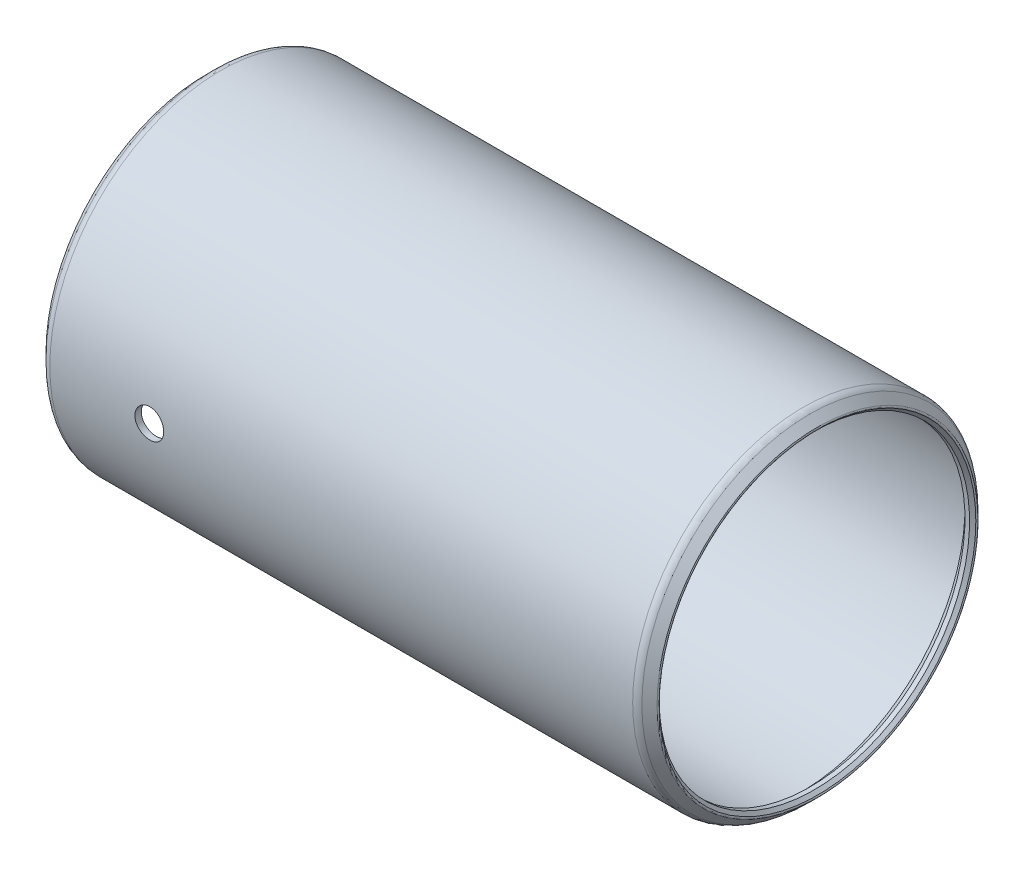
ISO-10303-21;
HEADER;
FILE_DESCRIPTION(('STEP AP214'),'2;1');
FILE_NAME('part.step','',(''),(''),'','','');
FILE_SCHEMA(('AUTOMOTIVE_DESIGN { 1 0 10303 214 1 1 1 1 }'));
ENDSEC;
DATA;
#1=APPLICATION_CONTEXT('core data for automotive mechanical design processes');
#2=APPLICATION_PROTOCOL_DEFINITION('international standard','automotive_design',2000,#1);
#3=PRODUCT_CONTEXT('',#1,'mechanical');
#4=PRODUCT('Part','Part','',(#3));
#5=PRODUCT_RELATED_PRODUCT_CATEGORY('part','',(#4));
#6=PRODUCT_DEFINITION_FORMATION('','',#4);
#7=PRODUCT_DEFINITION_CONTEXT('part definition',#1,'design');
#8=PRODUCT_DEFINITION('design','',#6,#7);
#9=PRODUCT_DEFINITION_SHAPE('','',#8);
#10=(LENGTH_UNIT() NAMED_UNIT(*) SI_UNIT(.MILLI.,.METRE.));
#11=(NAMED_UNIT(*) PLANE_ANGLE_UNIT() SI_UNIT($,.RADIAN.));
#12=(NAMED_UNIT(*) SI_UNIT($,.STERADIAN.) SOLID_ANGLE_UNIT());
#13=UNCERTAINTY_MEASURE_WITH_UNIT(LENGTH_MEASURE(1.E-05),#10,'distance_accuracy_value','');
#14=(GEOMETRIC_REPRESENTATION_CONTEXT(3) GLOBAL_UNCERTAINTY_ASSIGNED_CONTEXT((#13)) GLOBAL_UNIT_ASSIGNED_CONTEXT((#10,
#11,#12)) REPRESENTATION_CONTEXT('',''));
#15=CARTESIAN_POINT('',(0.,0.,0.));
#16=DIRECTION('',(0.,0.,1.));
#17=DIRECTION('',(1.,0.,0.));
#18=AXIS2_PLACEMENT_3D('',#15,#16,#17);
#19=CARTESIAN_POINT('',(49.3014,0.,0.));
#20=DIRECTION('',(-1.,0.,0.));
#21=DIRECTION('',(0.,0.,1.));
#22=AXIS2_PLACEMENT_3D('',#19,#20,#21);
#23=CYLINDRICAL_SURFACE('',#22,13.60805);
#24=CARTESIAN_POINT('',(0.761999999999999,0.,0.));
#25=DIRECTION('',(-1.,0.,0.));
#26=DIRECTION('',(0.,0.,1.));
#27=AXIS2_PLACEMENT_3D('',#24,#25,#26);
#28=CIRCLE('',#27,13.60805);
#29=CARTESIAN_POINT('',(0.761999999999999,0.,13.60805));
#30=VERTEX_POINT('',#29);
#31=EDGE_CURVE('E56',#30,#30,#28,.T.);
#32=ORIENTED_EDGE('',*,*,#31,.T.);
#33=EDGE_LOOP('',(#32));
#34=FACE_BOUND('',#33,.T.);
#35=CARTESIAN_POINT('',(48.5394,0.,0.));
#36=DIRECTION('',(-1.,0.,0.));
#37=DIRECTION('',(0.,0.,1.));
#38=AXIS2_PLACEMENT_3D('',#35,#36,#37);
#39=CIRCLE('',#38,13.60805);
#40=CARTESIAN_POINT('',(48.5394,0.,13.60805));
#41=VERTEX_POINT('',#40);
#42=EDGE_CURVE('E59',#41,#41,#39,.T.);
#43=ORIENTED_EDGE('',*,*,#42,.F.);
#44=EDGE_LOOP('',(#43));
#45=FACE_BOUND('',#44,.T.);
#46=CARTESIAN_POINT('',(9.9568,0.,13.60805));
#47=CARTESIAN_POINT('',(9.95679708301894,-0.0669182546482714,13.608049316548));
#48=CARTESIAN_POINT('',(9.9511544323396,-0.133881741871161,13.6075511313661));
#49=CARTESIAN_POINT('',(9.92872838455429,-0.265955050546539,13.6056116722791));
#50=CARTESIAN_POINT('',(9.91193245128793,-0.331062700079983,13.6041693371863));
#51=CARTESIAN_POINT('',(9.8676900846028,-0.457492452892776,13.600504525612));
#52=CARTESIAN_POINT('',(9.84024977771192,-0.518816710269826,13.5982824979641));
#53=CARTESIAN_POINT('',(9.77550878988491,-0.635974564806711,13.5933073106333));
#54=CARTESIAN_POINT('',(9.73821018149235,-0.691809312663339,13.5905542626213));
#55=CARTESIAN_POINT('',(9.65469848449648,-0.7965743137312,13.5848171871262));
#56=CARTESIAN_POINT('',(9.60846341826353,-0.845487018835932,13.5818326012789));
#57=CARTESIAN_POINT('',(9.50843782103866,-0.934868846378991,13.5759734995207));
#58=CARTESIAN_POINT('',(9.4546469541021,-0.975337593184629,13.5730989885111));
#59=CARTESIAN_POINT('',(9.34092941918919,-1.04674292044388,13.5677795828556));
#60=CARTESIAN_POINT('',(9.280992951096,-1.07766395049416,13.565335391827));
#61=CARTESIAN_POINT('',(9.1567538010192,-1.12899678917914,13.5611599143374));
#62=CARTESIAN_POINT('',(9.09245120371227,-1.14940880155976,13.5594286140552));
#63=CARTESIAN_POINT('',(8.96148184852376,-1.17909296626753,13.5568797393416));
#64=CARTESIAN_POINT('',(8.8948216509038,-1.18839385737639,13.5560598080495));
#65=CARTESIAN_POINT('',(8.76088164230416,-1.19568055751461,13.5554190966986));
#66=CARTESIAN_POINT('',(8.69360184412538,-1.19366659978648,13.555598296044));
#67=CARTESIAN_POINT('',(8.56052969101664,-1.17840450616186,13.5569334538123));
#68=CARTESIAN_POINT('',(8.49473371875241,-1.16518763914177,13.5580866935214));
#69=CARTESIAN_POINT('',(8.36629761654667,-1.12794350298004,13.5612357313031));
#70=CARTESIAN_POINT('',(8.30365752035618,-1.10391611825092,13.5632315383846));
#71=CARTESIAN_POINT('',(8.18321185861607,-1.04569810788095,13.5678439633093));
#72=CARTESIAN_POINT('',(8.12541308946077,-1.0114934917358,13.5704614347403));
#73=CARTESIAN_POINT('',(8.01636511195066,-0.933902039337988,13.5760214947568));
#74=CARTESIAN_POINT('',(7.96511605083599,-0.890514996718806,13.5789640906484));
#75=CARTESIAN_POINT('',(7.87044047693493,-0.795615092475709,13.5848549435303));
#76=CARTESIAN_POINT('',(7.82704104819841,-0.744075205315693,13.5878031859359));
#77=CARTESIAN_POINT('',(7.74950622419902,-0.63442681602597,13.5933636651988));
#78=CARTESIAN_POINT('',(7.71537083604385,-0.576318308856632,13.5959759017984));
#79=CARTESIAN_POINT('',(7.65733461000234,-0.455164276524884,13.6005706231754));
#80=CARTESIAN_POINT('',(7.63343501463544,-0.392118153085045,13.6025530314905));
#81=CARTESIAN_POINT('',(7.5965679764888,-0.262886805098121,13.6056638839094));
#82=CARTESIAN_POINT('',(7.58360028224248,-0.196701652795131,13.6067923476564));
#83=CARTESIAN_POINT('',(7.56899920769066,-0.0633057084379338,13.6080656427365));
#84=CARTESIAN_POINT('',(7.5673284262197,0.00390096014763275,13.6082137198431));
#85=CARTESIAN_POINT('',(7.57527056376644,0.137638382320868,13.6075182347554));
#86=CARTESIAN_POINT('',(7.58488336595981,0.204169142899341,13.6066746828279));
#87=CARTESIAN_POINT('',(7.61508879198431,0.334559219682892,13.6040928727499));
#88=CARTESIAN_POINT('',(7.63566403643894,0.398422592305757,13.6023560309328));
#89=CARTESIAN_POINT('',(7.68719251361759,0.521790806302529,13.5981826863816));
#90=CARTESIAN_POINT('',(7.71814592753115,0.581295571558635,13.5957461714322));
#91=CARTESIAN_POINT('',(7.78964577513802,0.694427383789485,13.5904383750868));
#92=CARTESIAN_POINT('',(7.83021693615532,0.748038749909508,13.5875659800053));
#93=CARTESIAN_POINT('',(7.91976495742895,0.847703536830346,13.5817127326722));
#94=CARTESIAN_POINT('',(7.96874197958377,0.893756812027454,13.5787318783325));
#95=CARTESIAN_POINT('',(8.07387396535874,0.977126813007207,13.5729880250846));
#96=CARTESIAN_POINT('',(8.13004834977849,1.01441909752546,13.5702256495799));
#97=CARTESIAN_POINT('',(8.24788402429577,1.07904083433481,13.5652405289984));
#98=CARTESIAN_POINT('',(8.30954525454217,1.10637039528381,13.5630177780363));
#99=CARTESIAN_POINT('',(8.43651841293467,1.15024944112672,13.559367185593));
#100=CARTESIAN_POINT('',(8.50182517357792,1.1668137844106,13.5579382488695));
#101=CARTESIAN_POINT('',(8.63430609227215,1.18874053042524,13.5560334832072));
#102=CARTESIAN_POINT('',(8.70148021010278,1.19410317423634,13.5555576337563));
#103=CARTESIAN_POINT('',(8.83554611693338,1.19347137557144,13.5556132553957));
#104=CARTESIAN_POINT('',(8.90243809165198,1.18751533298986,13.5561413205969));
#105=CARTESIAN_POINT('',(9.03426766120116,1.1644954120055,13.5581380294439));
#106=CARTESIAN_POINT('',(9.09920525322321,1.14743151764102,13.5596066744412));
#107=CARTESIAN_POINT('',(9.22528451287958,1.10269022427221,13.5633181559878));
#108=CARTESIAN_POINT('',(9.2864264674737,1.07501362875311,13.5655609339264));
#109=CARTESIAN_POINT('',(9.40320259425023,1.00983676557016,13.5705680835019));
#110=CARTESIAN_POINT('',(9.45883683910169,0.972336627542543,13.5733324482555));
#111=CARTESIAN_POINT('',(9.56321493671497,0.888432807982476,13.5790824775698));
#112=CARTESIAN_POINT('',(9.61193584490628,0.842000630023596,13.5820688311231));
#113=CARTESIAN_POINT('',(9.70091338867967,0.741603984891418,13.5879200468851));
#114=CARTESIAN_POINT('',(9.74116797861839,0.6876377025462,13.5907848795984));
#115=CARTESIAN_POINT('',(9.81213036633629,0.573589955763267,13.5960759911951));
#116=CARTESIAN_POINT('',(9.84281871286696,0.513496357359421,13.5985013723955));
#117=CARTESIAN_POINT('',(9.89362986284665,0.389028363158872,13.6026300080547));
#118=CARTESIAN_POINT('',(9.91376475422052,0.324658960547063,13.6043340882591));
#119=CARTESIAN_POINT('',(9.93779579646115,0.216594595648881,13.6063929318442));
#120=CARTESIAN_POINT('',(9.94491283573995,0.17359363107121,13.6070114866693));
#121=CARTESIAN_POINT('',(9.95441587945564,0.0870681605825598,13.6078402424959));
#122=CARTESIAN_POINT('',(9.95680189807731,0.0435436562416747,13.6080504447217));
#123=CARTESIAN_POINT('',(9.9568,0.,13.60805));
#124=B_SPLINE_CURVE_WITH_KNOTS('',3,(#46,#47,#48,#49,#50,#51,#52,#53,#54,#55,#56,#57,#58,#59,
#60,#61,#62,#63,#64,#65,#66,#67,#68,#69,#70,#71,#72,#73,#74,#75,#76,#77,#78,#79,#80,#81,#82,#83,
#84,#85,#86,#87,#88,#89,#90,#91,#92,#93,#94,#95,#96,#97,#98,#99,#100,#101,#102,#103,#104,#105,
#106,#107,#108,#109,#110,#111,#112,#113,#114,#115,#116,#117,#118,#119,#120,#121,#122,#123),
.UNSPECIFIED.,.T.,.F.,(4,2,2,2,2,2,2,2,2,2,2,2,2,2,2,2,2,2,2,2,2,2,2,2,2,2,2,2,2,2,2,2,2,2,2,2,
2,2,4),(0.,0.200595776364208,0.401417402555723,0.602123613959345,0.802787663743493,
1.00395163894922,1.20512456110373,1.40662342685357,1.60811838585192,1.80909104431727,
2.01005955997897,2.21046898470325,2.41088055228259,2.61156890595592,2.81226177039288,
3.01363441008906,3.21500720428504,3.41640443613274,3.61779703511228,3.81852254723748,
4.0192459811741,4.21965213971364,4.42006179727014,4.62099240769906,4.82192688852443,
5.02341544728019,5.22490180844603,5.42610947975999,5.62731282068517,5.82783477543158,
6.02835701832369,6.22886408271802,6.42936850125701,6.63052354054656,6.83172712749547,
7.03333719694748,7.23471583483494,7.36524374182047,7.49577125745048),.UNSPECIFIED.);
#125=CARTESIAN_POINT('',(9.9568,0.,13.60805));
#126=VERTEX_POINT('',#125);
#127=EDGE_CURVE('E89',#126,#126,#124,.T.);
#128=ORIENTED_EDGE('',*,*,#127,.F.);
#129=EDGE_LOOP('',(#128));
#130=FACE_BOUND('',#129,.T.);
#131=ADVANCED_FACE('F32',(#34,#45,#130),#23,.F.);
#132=CARTESIAN_POINT('',(49.3014,0.,0.));
#133=DIRECTION('',(-1.,0.,0.));
#134=DIRECTION('',(0.,0.,1.));
#135=AXIS2_PLACEMENT_3D('',#132,#133,#134);
#136=CYLINDRICAL_SURFACE('',#135,14.1351000000002);
#137=CARTESIAN_POINT('',(0.527049999997843,0.,0.));
#138=DIRECTION('',(-1.,0.,0.));
#139=DIRECTION('',(0.,0.,1.));
#140=AXIS2_PLACEMENT_3D('',#137,#138,#139);
#141=CIRCLE('',#140,14.1351000000002);
#142=CARTESIAN_POINT('',(0.527049999997843,0.,14.1351000000002));
#143=VERTEX_POINT('',#142);
#144=EDGE_CURVE('E80',#143,#143,#141,.T.);
#145=ORIENTED_EDGE('',*,*,#144,.F.);
#146=EDGE_LOOP('',(#145));
#147=FACE_BOUND('',#146,.T.);
#148=CARTESIAN_POINT('',(48.7743500000017,0.,0.));
#149=DIRECTION('',(-1.,0.,0.));
#150=DIRECTION('',(0.,0.,1.));
#151=AXIS2_PLACEMENT_3D('',#148,#149,#150);
#152=CIRCLE('',#151,14.1351000000002);
#153=CARTESIAN_POINT('',(48.7743500000017,0.,14.1351000000002));
#154=VERTEX_POINT('',#153);
#155=EDGE_CURVE('E77',#154,#154,#152,.T.);
#156=ORIENTED_EDGE('',*,*,#155,.T.);
#157=EDGE_LOOP('',(#156));
#158=FACE_BOUND('',#157,.T.);
#159=CARTESIAN_POINT('',(7.5692,0.,14.1351000000002));
#160=CARTESIAN_POINT('',(7.56920292181596,-0.0669283271261537,14.1350993401614));
#161=CARTESIAN_POINT('',(7.57484726399437,-0.133902135301032,14.1346195848798));
#162=CARTESIAN_POINT('',(7.59728042319043,-0.265996491031899,14.1327518733435));
#163=CARTESIAN_POINT('',(7.6140818446467,-0.331114855572768,14.1313628899358));
#164=CARTESIAN_POINT('',(7.65833963765327,-0.457566086300831,14.1278336735272));
#165=CARTESIAN_POINT('',(7.68578995527623,-0.518901080423648,14.125693867437));
#166=CARTESIAN_POINT('',(7.75055543839332,-0.636078307307289,14.1209029302645));
#167=CARTESIAN_POINT('',(7.78786850294064,-0.691921706407142,14.1182519081132));
#168=CARTESIAN_POINT('',(7.87140556793543,-0.796691100327122,14.1127282376208));
#169=CARTESIAN_POINT('',(7.91765002219988,-0.845600761572882,14.1098550898244));
#170=CARTESIAN_POINT('',(8.01769391089028,-0.934974155924522,14.1042151767763));
#171=CARTESIAN_POINT('',(8.07149367808737,-0.975437516820743,14.1014484162173));
#172=CARTESIAN_POINT('',(8.18522013921747,-1.04682516542564,14.0963291859555));
#173=CARTESIAN_POINT('',(8.24515589291446,-1.07773506898988,14.0939773432359));
#174=CARTESIAN_POINT('',(8.36938985270397,-1.12904650202633,14.0899599818293));
#175=CARTESIAN_POINT('',(8.4336879798337,-1.14944822164851,14.0882944507233));
#176=CARTESIAN_POINT('',(8.56465764061446,-1.17911671021048,14.0858425083406));
#177=CARTESIAN_POINT('',(8.63132309864346,-1.18841012291819,14.0850539938179));
#178=CARTESIAN_POINT('',(8.76527196549844,-1.19568050509525,14.08443872305));
#179=CARTESIAN_POINT('',(8.83255536241638,-1.19365769217976,14.0846119483102));
#180=CARTESIAN_POINT('',(8.96564752296844,-1.17837506017275,14.0858986730768));
#181=CARTESIAN_POINT('',(9.03145963928094,-1.1651442060237,14.0870097488696));
#182=CARTESIAN_POINT('',(9.15992568462764,-1.12786607104217,14.0900431828305));
#183=CARTESIAN_POINT('',(9.22257958207598,-1.10381868205565,14.0919655491106));
#184=CARTESIAN_POINT('',(9.34304293012354,-1.04555769253766,14.0964077496589));
#185=CARTESIAN_POINT('',(9.40084607074476,-1.01133110566503,14.0989283462984));
#186=CARTESIAN_POINT('',(9.50989807835045,-0.933692647803003,14.1042822979228));
#187=CARTESIAN_POINT('',(9.56114680890691,-0.890280585670664,14.1071156594157));
#188=CARTESIAN_POINT('',(9.65580364295232,-0.795341071971393,14.1127866730802));
#189=CARTESIAN_POINT('',(9.69918663747083,-0.743788581375683,14.115624310815));
#190=CARTESIAN_POINT('',(9.77668634820717,-0.634118926305164,14.1209756782484));
#191=CARTESIAN_POINT('',(9.81080305801055,-0.576001757286086,14.1234894077227));
#192=CARTESIAN_POINT('',(9.86880022219154,-0.454836092003784,14.1279102278279));
#193=CARTESIAN_POINT('',(9.89267955450346,-0.391787056079347,14.1298172519551));
#194=CARTESIAN_POINT('',(9.92950648637397,-0.262554923079166,14.1328090346272));
#195=CARTESIAN_POINT('',(9.94245431896717,-0.196371892844792,14.1338938107006));
#196=CARTESIAN_POINT('',(9.95701920600603,-0.0629680933603924,14.1351166222717));
#197=CARTESIAN_POINT('',(9.95867094036536,0.0042488641500376,14.1352575554143));
#198=CARTESIAN_POINT('',(9.95068760810625,0.138003690936404,14.1345845426698));
#199=CARTESIAN_POINT('',(9.94105264966805,0.204541566715009,14.1337706059351));
#200=CARTESIAN_POINT('',(9.91079817844433,0.334950504129665,14.1312812487312));
#201=CARTESIAN_POINT('',(9.89019475037927,0.398825323483858,14.1296070898602));
#202=CARTESIAN_POINT('',(9.83860463060446,0.52221140061772,14.1255853425755));
#203=CARTESIAN_POINT('',(9.80761777042593,0.581722587579367,14.1232377432353));
#204=CARTESIAN_POINT('',(9.73605330986646,0.6948498536896,14.1181250228166));
#205=CARTESIAN_POINT('',(9.69545274639488,0.748451360742455,14.1153589078816));
#206=CARTESIAN_POINT('',(9.60584653631726,0.848090595113095,14.1097232324077));
#207=CARTESIAN_POINT('',(9.55684073971241,0.894128187417424,14.1068536700234));
#208=CARTESIAN_POINT('',(9.45166461794951,0.977451800981744,14.1013259313809));
#209=CARTESIAN_POINT('',(9.39547632423666,1.01471518341474,14.0986683133941));
#210=CARTESIAN_POINT('',(9.27761957894872,1.07927735451325,14.0938733119402));
#211=CARTESIAN_POINT('',(9.21595118336847,1.10657624497985,14.0917359231583));
#212=CARTESIAN_POINT('',(9.08896477896685,1.15039599483741,14.0882265385032));
#213=CARTESIAN_POINT('',(9.02365157231614,1.16693068869567,14.0868535605165));
#214=CARTESIAN_POINT('',(8.89116384521411,1.18879771905824,14.08502517905));
#215=CARTESIAN_POINT('',(8.82398936161352,1.19413027718917,14.0845697574169));
#216=CARTESIAN_POINT('',(8.68991090470376,1.1934390725901,14.0846283256227));
#217=CARTESIAN_POINT('',(8.62300674382314,1.1874508799686,14.0851392790867));
#218=CARTESIAN_POINT('',(8.4911579962589,1.16436235213308,14.0870665729209));
#219=CARTESIAN_POINT('',(8.42621341252206,1.14726200020965,14.0884829146525));
#220=CARTESIAN_POINT('',(8.30012520184654,1.10244363127395,14.0920605969999));
#221=CARTESIAN_POINT('',(8.23898133647735,1.07472628108087,14.0942218908269));
#222=CARTESIAN_POINT('',(8.12220888360784,1.00946467384946,14.0990460309783));
#223=CARTESIAN_POINT('',(8.06658021301955,0.971920564885073,14.1017088697449));
#224=CARTESIAN_POINT('',(7.962235186184,0.887937513679702,14.1072460196814));
#225=CARTESIAN_POINT('',(7.91354007085993,0.841472220861158,14.1101209413925));
#226=CARTESIAN_POINT('',(7.82462008071477,0.741013935895547,14.1157527492686));
#227=CARTESIAN_POINT('',(7.78439725693728,0.687019126185856,14.1185096067233));
#228=CARTESIAN_POINT('',(7.71350817019649,0.572927772140121,14.1235997666305));
#229=CARTESIAN_POINT('',(7.68286022000887,0.512819823292392,14.1259322539245));
#230=CARTESIAN_POINT('',(7.63213124684047,0.388332241258136,14.1299013567546));
#231=CARTESIAN_POINT('',(7.61203809165175,0.323957608729381,14.1315387708251));
#232=CARTESIAN_POINT('',(7.58809979422027,0.216003457892249,14.1335134371226));
#233=CARTESIAN_POINT('',(7.58102180785904,0.173117960922013,14.134105685622));
#234=CARTESIAN_POINT('',(7.57157096934717,0.0868280234485226,14.1348991805792));
#235=CARTESIAN_POINT('',(7.5691981043046,0.043423584367487,14.1351004281084));
#236=CARTESIAN_POINT('',(7.5692,0.,14.1351000000002));
#237=B_SPLINE_CURVE_WITH_KNOTS('',3,(#159,#160,#161,#162,#163,#164,#165,#166,#167,#168,#169,
#170,#171,#172,#173,#174,#175,#176,#177,#178,#179,#180,#181,#182,#183,#184,#185,#186,#187,#188,
#189,#190,#191,#192,#193,#194,#195,#196,#197,#198,#199,#200,#201,#202,#203,#204,#205,#206,#207,
#208,#209,#210,#211,#212,#213,#214,#215,#216,#217,#218,#219,#220,#221,#222,#223,#224,#225,#226,
#227,#228,#229,#230,#231,#232,#233,#234,#235,#236),.UNSPECIFIED.,.T.,.F.,(4,2,2,2,2,2,2,2,2,2,2,
2,2,2,2,2,2,2,2,2,2,2,2,2,2,2,2,2,2,2,2,2,2,2,2,2,2,2,4),(0.,0.200626436393935,
0.401479912090747,0.60221936896414,0.80291609904774,1.00407801556242,1.20524879496448,
1.40672100759489,1.60818957437337,1.80917393388867,2.01015442841468,2.21061710799124,
2.41108179202985,2.61180332856396,2.81252904237544,3.01388464415477,3.21524038531934,
3.41661819040051,3.61799170245818,3.81874670329254,4.01949977995424,4.21995926979817,
4.42042201220841,4.62136849367328,4.82231856157891,5.02378156560598,5.2252425113519,
5.42644401960252,5.62764154718096,5.82820795709324,6.02877466859883,6.22932878522545,
6.4298798799882,6.63103271998156,6.83223420091932,7.03381817408425,7.23516992672128,
7.36533817134602,7.49550605931189),.UNSPECIFIED.);
#238=CARTESIAN_POINT('',(7.5692,0.,14.1351000000002));
#239=VERTEX_POINT('',#238);
#240=EDGE_CURVE('E10',#239,#239,#237,.T.);
#241=ORIENTED_EDGE('',*,*,#240,.F.);
#242=EDGE_LOOP('',(#241));
#243=FACE_BOUND('',#242,.T.);
#244=ADVANCED_FACE('F110',(#147,#158,#243),#136,.T.);
#245=CARTESIAN_POINT('',(-0.549710244842028,0.,0.));
#246=DIRECTION('',(-1.,0.,0.));
#247=DIRECTION('',(0.,0.,1.));
#248=AXIS2_PLACEMENT_3D('',#245,#246,#247);
#249=TOROIDAL_SURFACE('',#248,13.194365367264,0.127000000000741);
#250=CARTESIAN_POINT('',(-0.639512806053462,0.,0.));
#251=DIRECTION('',(-1.,0.,0.));
#252=DIRECTION('',(0.,0.,1.));
#253=AXIS2_PLACEMENT_3D('',#250,#251,#252);
#254=CIRCLE('',#253,13.104562806053);
#255=CARTESIAN_POINT('',(-0.639512806053462,0.,13.104562806053));
#256=VERTEX_POINT('',#255);
#257=EDGE_CURVE('E43',#256,#256,#254,.T.);
#258=ORIENTED_EDGE('',*,*,#257,.F.);
#259=EDGE_LOOP('',(#258));
#260=FACE_BOUND('',#259,.T.);
#261=CARTESIAN_POINT('',(-0.639512806053018,0.,0.));
#262=DIRECTION('',(-1.,0.,0.));
#263=DIRECTION('',(0.,0.,1.));
#264=AXIS2_PLACEMENT_3D('',#261,#262,#263);
#265=CIRCLE('',#264,13.2841679284754);
#266=CARTESIAN_POINT('',(-0.639512806053018,0.,13.2841679284754));
#267=VERTEX_POINT('',#266);
#268=EDGE_CURVE('E86',#267,#267,#265,.T.);
#269=ORIENTED_EDGE('',*,*,#268,.T.);
#270=EDGE_LOOP('',(#269));
#271=FACE_BOUND('',#270,.T.);
#272=ADVANCED_FACE('F34',(#260,#271),#249,.T.);
#273=CARTESIAN_POINT('',(-0.639512806053462,0.,0.));
#274=DIRECTION('',(-1.,0.,0.));
#275=DIRECTION('',(0.,0.,1.));
#276=AXIS2_PLACEMENT_3D('',#273,#274,#275);
#277=CONICAL_SURFACE('',#276,13.104562806053,0.785398163396556);
#278=CARTESIAN_POINT('',(-0.380999999999999,0.,0.));
#279=DIRECTION('',(-1.,0.,0.));
#280=DIRECTION('',(0.,0.,1.));
#281=AXIS2_PLACEMENT_3D('',#278,#279,#280);
#282=CIRCLE('',#281,12.84605);
#283=CARTESIAN_POINT('',(-0.380999999999999,0.,12.84605));
#284=VERTEX_POINT('',#283);
#285=EDGE_CURVE('E47',#284,#284,#282,.T.);
#286=ORIENTED_EDGE('',*,*,#285,.F.);
#287=EDGE_LOOP('',(#286));
#288=FACE_BOUND('',#287,.T.);
#289=ORIENTED_EDGE('',*,*,#257,.T.);
#290=EDGE_LOOP('',(#289));
#291=FACE_BOUND('',#290,.T.);
#292=ADVANCED_FACE('F159',(#288,#291),#277,.F.);
#293=CARTESIAN_POINT('',(49.3014,0.,0.));
#294=DIRECTION('',(-1.,0.,0.));
#295=DIRECTION('',(0.,0.,1.));
#296=AXIS2_PLACEMENT_3D('',#293,#294,#295);
#297=CYLINDRICAL_SURFACE('',#296,12.84605);
#298=CARTESIAN_POINT('',(0.,0.,0.));
#299=DIRECTION('',(-1.,0.,0.));
#300=DIRECTION('',(0.,0.,1.));
#301=AXIS2_PLACEMENT_3D('',#298,#299,#300);
#302=CIRCLE('',#301,12.84605);
#303=CARTESIAN_POINT('',(0.,0.,12.84605));
#304=VERTEX_POINT('',#303);
#305=EDGE_CURVE('E51',#304,#304,#302,.T.);
#306=ORIENTED_EDGE('',*,*,#305,.F.);
#307=EDGE_LOOP('',(#306));
#308=FACE_BOUND('',#307,.T.);
#309=ORIENTED_EDGE('',*,*,#285,.T.);
#310=EDGE_LOOP('',(#309));
#311=FACE_BOUND('',#310,.T.);
#312=ADVANCED_FACE('F140',(#308,#311),#297,.F.);
#313=CARTESIAN_POINT('',(0.,0.,0.));
#314=DIRECTION('',(1.,0.,0.));
#315=DIRECTION('',(0.,0.,-1.));
#316=AXIS2_PLACEMENT_3D('',#313,#314,#315);
#317=CONICAL_SURFACE('',#316,12.84605,0.78539816339745);
#318=ORIENTED_EDGE('',*,*,#31,.F.);
#319=EDGE_LOOP('',(#318));
#320=FACE_BOUND('',#319,.T.);
#321=ORIENTED_EDGE('',*,*,#305,.T.);
#322=EDGE_LOOP('',(#321));
#323=FACE_BOUND('',#322,.T.);
#324=ADVANCED_FACE('F135',(#320,#323),#317,.F.);
#325=CARTESIAN_POINT('',(48.5394,0.,0.));
#326=DIRECTION('',(-1.,0.,0.));
#327=DIRECTION('',(0.,0.,1.));
#328=AXIS2_PLACEMENT_3D('',#325,#326,#327);
#329=CONICAL_SURFACE('',#328,13.60805,0.78539816339745);
#330=CARTESIAN_POINT('',(49.3014,0.,0.));
#331=DIRECTION('',(-1.,0.,0.));
#332=DIRECTION('',(0.,0.,1.));
#333=AXIS2_PLACEMENT_3D('',#330,#331,#332);
#334=CIRCLE('',#333,12.84605);
#335=CARTESIAN_POINT('',(49.3014,0.,12.84605));
#336=VERTEX_POINT('',#335);
#337=EDGE_CURVE('E62',#336,#336,#334,.T.);
#338=ORIENTED_EDGE('',*,*,#337,.F.);
#339=EDGE_LOOP('',(#338));
#340=FACE_BOUND('',#339,.T.);
#341=ORIENTED_EDGE('',*,*,#42,.T.);
#342=EDGE_LOOP('',(#341));
#343=FACE_BOUND('',#342,.T.);
#344=ADVANCED_FACE('F132',(#340,#343),#329,.F.);
#345=CARTESIAN_POINT('',(49.3014,0.,0.));
#346=DIRECTION('',(-1.,0.,0.));
#347=DIRECTION('',(0.,0.,1.));
#348=AXIS2_PLACEMENT_3D('',#345,#346,#347);
#349=CYLINDRICAL_SURFACE('',#348,12.84605);
#350=CARTESIAN_POINT('',(49.6824,0.,0.));
#351=DIRECTION('',(-1.,0.,0.));
#352=DIRECTION('',(0.,0.,1.));
#353=AXIS2_PLACEMENT_3D('',#350,#351,#352);
#354=CIRCLE('',#353,12.84605);
#355=CARTESIAN_POINT('',(49.6824,0.,12.84605));
#356=VERTEX_POINT('',#355);
#357=EDGE_CURVE('E65',#356,#356,#354,.T.);
#358=ORIENTED_EDGE('',*,*,#357,.F.);
#359=EDGE_LOOP('',(#358));
#360=FACE_BOUND('',#359,.T.);
#361=ORIENTED_EDGE('',*,*,#337,.T.);
#362=EDGE_LOOP('',(#361));
#363=FACE_BOUND('',#362,.T.);
#364=ADVANCED_FACE('F129',(#360,#363),#349,.F.);
#365=CARTESIAN_POINT('',(49.6824,0.,0.));
#366=DIRECTION('',(1.,0.,0.));
#367=DIRECTION('',(0.,0.,-1.));
#368=AXIS2_PLACEMENT_3D('',#365,#366,#367);
#369=CONICAL_SURFACE('',#368,12.84605,0.785398163397321);
#370=CARTESIAN_POINT('',(49.9409128060541,0.,0.));
#371=DIRECTION('',(-1.,0.,0.));
#372=DIRECTION('',(0.,0.,1.));
#373=AXIS2_PLACEMENT_3D('',#370,#371,#372);
#374=CIRCLE('',#373,13.104562806054);
#375=CARTESIAN_POINT('',(49.9409128060541,0.,13.104562806054));
#376=VERTEX_POINT('',#375);
#377=EDGE_CURVE('E68',#376,#376,#374,.T.);
#378=ORIENTED_EDGE('',*,*,#377,.F.);
#379=EDGE_LOOP('',(#378));
#380=FACE_BOUND('',#379,.T.);
#381=ORIENTED_EDGE('',*,*,#357,.T.);
#382=EDGE_LOOP('',(#381));
#383=FACE_BOUND('',#382,.T.);
#384=ADVANCED_FACE('F125',(#380,#383),#369,.F.);
#385=CARTESIAN_POINT('',(49.8511102448439,0.,0.));
#386=DIRECTION('',(-1.,0.,0.));
#387=DIRECTION('',(0.,0.,1.));
#388=AXIS2_PLACEMENT_3D('',#385,#386,#387);
#389=TOROIDAL_SURFACE('',#388,13.194365367264,0.126999999999108);
#390=CARTESIAN_POINT('',(49.940912806054,0.,0.));
#391=DIRECTION('',(-1.,0.,0.));
#392=DIRECTION('',(0.,0.,1.));
#393=AXIS2_PLACEMENT_3D('',#390,#391,#392);
#394=CIRCLE('',#393,13.2841679284741);
#395=CARTESIAN_POINT('',(49.940912806054,0.,13.2841679284741));
#396=VERTEX_POINT('',#395);
#397=EDGE_CURVE('E71',#396,#396,#394,.T.);
#398=ORIENTED_EDGE('',*,*,#397,.F.);
#399=EDGE_LOOP('',(#398));
#400=FACE_BOUND('',#399,.T.);
#401=ORIENTED_EDGE('',*,*,#377,.T.);
#402=EDGE_LOOP('',(#401));
#403=FACE_BOUND('',#402,.T.);
#404=ADVANCED_FACE('F121',(#400,#403),#389,.T.);
#405=CARTESIAN_POINT('',(49.940912806054,0.,0.));
#406=DIRECTION('',(-1.,0.,0.));
#407=DIRECTION('',(0.,0.,1.));
#408=AXIS2_PLACEMENT_3D('',#405,#406,#407);
#409=CONICAL_SURFACE('',#408,13.2841679284741,0.785398163397483);
#410=CARTESIAN_POINT('',(49.3131653672624,0.,0.));
#411=DIRECTION('',(-1.,0.,0.));
#412=DIRECTION('',(0.,0.,1.));
#413=AXIS2_PLACEMENT_3D('',#410,#411,#412);
#414=CIRCLE('',#413,13.9119153672658);
#415=CARTESIAN_POINT('',(49.3131653672624,0.,13.9119153672658));
#416=VERTEX_POINT('',#415);
#417=EDGE_CURVE('E74',#416,#416,#414,.T.);
#418=ORIENTED_EDGE('',*,*,#417,.F.);
#419=EDGE_LOOP('',(#418));
#420=FACE_BOUND('',#419,.T.);
#421=ORIENTED_EDGE('',*,*,#397,.T.);
#422=EDGE_LOOP('',(#421));
#423=FACE_BOUND('',#422,.T.);
#424=ADVANCED_FACE('F117',(#420,#423),#409,.T.);
#425=CARTESIAN_POINT('',(48.7743500000017,0.,0.));
#426=DIRECTION('',(-1.,0.,0.));
#427=DIRECTION('',(0.,0.,1.));
#428=AXIS2_PLACEMENT_3D('',#425,#426,#427);
#429=TOROIDAL_SURFACE('',#428,13.3731000000049,0.761999999995191);
#430=ORIENTED_EDGE('',*,*,#155,.F.);
#431=EDGE_LOOP('',(#430));
#432=FACE_BOUND('',#431,.T.);
#433=ORIENTED_EDGE('',*,*,#417,.T.);
#434=EDGE_LOOP('',(#433));
#435=FACE_BOUND('',#434,.T.);
#436=ADVANCED_FACE('F108',(#432,#435),#429,.T.);
#437=CARTESIAN_POINT('',(0.527049999997999,0.,0.));
#438=DIRECTION('',(-1.,0.,0.));
#439=DIRECTION('',(0.,0.,1.));
#440=AXIS2_PLACEMENT_3D('',#437,#438,#439);
#441=TOROIDAL_SURFACE('',#440,13.3731000000052,0.761999999994996);
#442=CARTESIAN_POINT('',(-0.0117653672626339,0.,0.));
#443=DIRECTION('',(-1.,0.,0.));
#444=DIRECTION('',(0.,0.,1.));
#445=AXIS2_PLACEMENT_3D('',#442,#443,#444);
#446=CIRCLE('',#445,13.9119153672658);
#447=CARTESIAN_POINT('',(-0.0117653672626339,0.,13.9119153672658));
#448=VERTEX_POINT('',#447);
#449=EDGE_CURVE('E83',#448,#448,#446,.T.);
#450=ORIENTED_EDGE('',*,*,#449,.F.);
#451=EDGE_LOOP('',(#450));
#452=FACE_BOUND('',#451,.T.);
#453=ORIENTED_EDGE('',*,*,#144,.T.);
#454=EDGE_LOOP('',(#453));
#455=FACE_BOUND('',#454,.T.);
#456=ADVANCED_FACE('F105',(#452,#455),#441,.T.);
#457=CARTESIAN_POINT('',(-0.0117653672626339,0.,0.));
#458=DIRECTION('',(1.,0.,0.));
#459=DIRECTION('',(0.,0.,-1.));
#460=AXIS2_PLACEMENT_3D('',#457,#458,#459);
#461=CONICAL_SURFACE('',#460,13.9119153672658,0.785398163397446);
#462=ORIENTED_EDGE('',*,*,#268,.F.);
#463=EDGE_LOOP('',(#462));
#464=FACE_BOUND('',#463,.T.);
#465=ORIENTED_EDGE('',*,*,#449,.T.);
#466=EDGE_LOOP('',(#465));
#467=FACE_BOUND('',#466,.T.);
#468=ADVANCED_FACE('F101',(#464,#467),#461,.T.);
#469=CARTESIAN_POINT('',(8.763,0.,14.1351));
#470=DIRECTION('',(0.,0.,-1.));
#471=DIRECTION('',(-1.,0.,0.));
#472=AXIS2_PLACEMENT_3D('',#469,#470,#471);
#473=CYLINDRICAL_SURFACE('',#472,1.1938);
#474=ORIENTED_EDGE('',*,*,#240,.T.);
#475=EDGE_LOOP('',(#474));
#476=FACE_BOUND('',#475,.T.);
#477=ORIENTED_EDGE('',*,*,#127,.T.);
#478=EDGE_LOOP('',(#477));
#479=FACE_BOUND('',#478,.T.);
#480=ADVANCED_FACE('F97',(#476,#479),#473,.F.);
#481=CLOSED_SHELL('',(#131,#244,#272,#292,#312,#324,#344,#364,#384,#404,#424,#436,#456,#468,#480));
#482=MANIFOLD_SOLID_BREP('B2',#481);
#483=ADVANCED_BREP_SHAPE_REPRESENTATION('',(#18,#482),#14);
#484=SHAPE_DEFINITION_REPRESENTATION(#9,#483);
ENDSEC;
END-ISO-10303-21;
